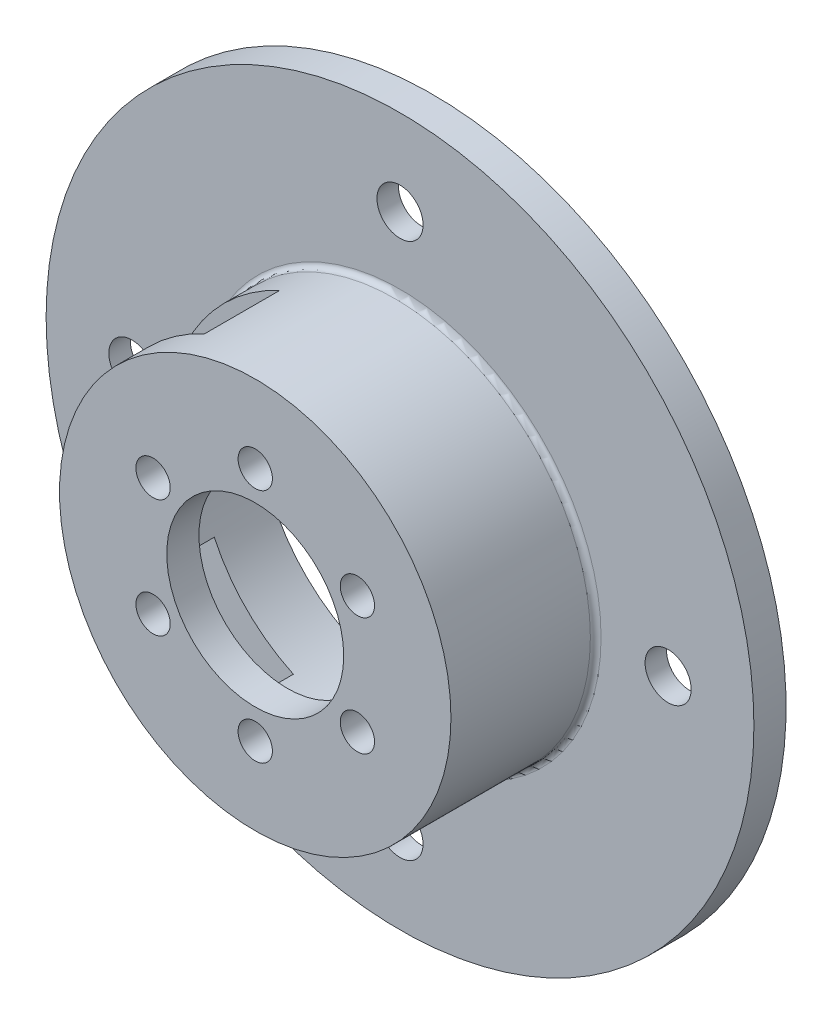
ISO-10303-21;
HEADER;
FILE_DESCRIPTION(('STEP AP214'),'2;1');
FILE_NAME('part.step','',(''),(''),'','','');
FILE_SCHEMA(('AUTOMOTIVE_DESIGN { 1 0 10303 214 1 1 1 1 }'));
ENDSEC;
DATA;
#1=APPLICATION_CONTEXT('core data for automotive mechanical design processes');
#2=APPLICATION_PROTOCOL_DEFINITION('international standard','automotive_design',2000,#1);
#3=PRODUCT_CONTEXT('',#1,'mechanical');
#4=PRODUCT('Part','Part','',(#3));
#5=PRODUCT_RELATED_PRODUCT_CATEGORY('part','',(#4));
#6=PRODUCT_DEFINITION_FORMATION('','',#4);
#7=PRODUCT_DEFINITION_CONTEXT('part definition',#1,'design');
#8=PRODUCT_DEFINITION('design','',#6,#7);
#9=PRODUCT_DEFINITION_SHAPE('','',#8);
#10=(LENGTH_UNIT() NAMED_UNIT(*) SI_UNIT(.MILLI.,.METRE.));
#11=(NAMED_UNIT(*) PLANE_ANGLE_UNIT() SI_UNIT($,.RADIAN.));
#12=(NAMED_UNIT(*) SI_UNIT($,.STERADIAN.) SOLID_ANGLE_UNIT());
#13=UNCERTAINTY_MEASURE_WITH_UNIT(LENGTH_MEASURE(1.E-05),#10,'distance_accuracy_value','');
#14=(GEOMETRIC_REPRESENTATION_CONTEXT(3) GLOBAL_UNCERTAINTY_ASSIGNED_CONTEXT((#13)) GLOBAL_UNIT_ASSIGNED_CONTEXT((#10,
#11,#12)) REPRESENTATION_CONTEXT('',''));
#15=CARTESIAN_POINT('',(0.,0.,0.));
#16=DIRECTION('',(0.,0.,1.));
#17=DIRECTION('',(1.,0.,0.));
#18=AXIS2_PLACEMENT_3D('',#15,#16,#17);
#19=CARTESIAN_POINT('',(0.,0.,4.));
#20=DIRECTION('',(0.,0.,-1.));
#21=DIRECTION('',(-1.,0.,0.));
#22=AXIS2_PLACEMENT_3D('',#19,#20,#21);
#23=CYLINDRICAL_SURFACE('',#22,15.25);
#24=DIRECTION('',(0.,0.,-1.));
#25=VECTOR('',#24,1.);
#26=CARTESIAN_POINT('',(-13.821193752309,6.44492849154558,4.));
#27=LINE('',#26,#25);
#28=CARTESIAN_POINT('',(-13.821193752309,6.44492849154558,7.5));
#29=VERTEX_POINT('',#28);
#30=CARTESIAN_POINT('',(-13.821193752309,6.44492849154558,14.));
#31=VERTEX_POINT('',#30);
#32=EDGE_CURVE('E168',#29,#31,#27,.F.);
#33=ORIENTED_EDGE('',*,*,#32,.T.);
#34=CARTESIAN_POINT('',(0.,0.,14.));
#35=DIRECTION('',(0.,0.,1.));
#36=DIRECTION('',(1.,0.,0.));
#37=AXIS2_PLACEMENT_3D('',#34,#35,#36);
#38=CIRCLE('',#37,15.25);
#39=CARTESIAN_POINT('',(-13.8211937523088,-6.44492849154597,14.));
#40=VERTEX_POINT('',#39);
#41=EDGE_CURVE('E224',#31,#40,#38,.T.);
#42=ORIENTED_EDGE('',*,*,#41,.T.);
#43=DIRECTION('',(0.,0.,-1.));
#44=VECTOR('',#43,1.);
#45=CARTESIAN_POINT('',(-13.8211937523088,-6.44492849154597,4.));
#46=LINE('',#45,#44);
#47=CARTESIAN_POINT('',(-13.8211937523088,-6.44492849154597,7.5));
#48=VERTEX_POINT('',#47);
#49=EDGE_CURVE('E140',#48,#40,#46,.F.);
#50=ORIENTED_EDGE('',*,*,#49,.F.);
#51=CARTESIAN_POINT('',(0.,0.,7.5));
#52=DIRECTION('',(0.,0.,1.));
#53=DIRECTION('',(1.,0.,0.));
#54=AXIS2_PLACEMENT_3D('',#51,#52,#53);
#55=CIRCLE('',#54,15.25);
#56=CARTESIAN_POINT('',(-6.44492849154553,-13.821193752309,7.5));
#57=VERTEX_POINT('',#56);
#58=EDGE_CURVE('E115',#48,#57,#55,.T.);
#59=ORIENTED_EDGE('',*,*,#58,.T.);
#60=DIRECTION('',(0.,0.,-1.));
#61=VECTOR('',#60,1.);
#62=CARTESIAN_POINT('',(-6.44492849154553,-13.821193752309,4.));
#63=LINE('',#62,#61);
#64=CARTESIAN_POINT('',(-6.44492849154553,-13.821193752309,14.5));
#65=VERTEX_POINT('',#64);
#66=EDGE_CURVE('E143',#57,#65,#63,.F.);
#67=ORIENTED_EDGE('',*,*,#66,.T.);
#68=CARTESIAN_POINT('',(0.,0.,14.5));
#69=DIRECTION('',(0.,0.,1.));
#70=DIRECTION('',(1.,0.,0.));
#71=AXIS2_PLACEMENT_3D('',#68,#69,#70);
#72=CIRCLE('',#71,15.25);
#73=CARTESIAN_POINT('',(-6.44492849154592,13.8211937523088,14.5));
#74=VERTEX_POINT('',#73);
#75=EDGE_CURVE('E214',#65,#74,#72,.T.);
#76=ORIENTED_EDGE('',*,*,#75,.T.);
#77=DIRECTION('',(0.,0.,-1.));
#78=VECTOR('',#77,1.);
#79=CARTESIAN_POINT('',(-6.44492849154592,13.8211937523088,4.));
#80=LINE('',#79,#78);
#81=CARTESIAN_POINT('',(-6.44492849154592,13.8211937523088,7.5));
#82=VERTEX_POINT('',#81);
#83=EDGE_CURVE('E163',#82,#74,#80,.F.);
#84=ORIENTED_EDGE('',*,*,#83,.F.);
#85=CARTESIAN_POINT('',(0.,0.,7.5));
#86=DIRECTION('',(0.,0.,1.));
#87=DIRECTION('',(1.,0.,0.));
#88=AXIS2_PLACEMENT_3D('',#85,#86,#87);
#89=CIRCLE('',#88,15.25);
#90=EDGE_CURVE('E171',#82,#29,#89,.T.);
#91=ORIENTED_EDGE('',*,*,#90,.T.);
#92=EDGE_LOOP('',(#33,#42,#50,#59,#67,#76,#84,#91));
#93=FACE_BOUND('',#92,.T.);
#94=CARTESIAN_POINT('',(0.,0.,2.));
#95=DIRECTION('',(0.,0.,-1.));
#96=DIRECTION('',(-1.,0.,0.));
#97=AXIS2_PLACEMENT_3D('',#94,#95,#96);
#98=CIRCLE('',#97,15.25);
#99=CARTESIAN_POINT('',(-15.25,0.,2.));
#100=VERTEX_POINT('',#99);
#101=EDGE_CURVE('E398',#100,#100,#98,.T.);
#102=ORIENTED_EDGE('',*,*,#101,.T.);
#103=EDGE_LOOP('',(#102));
#104=FACE_BOUND('',#103,.T.);
#105=ADVANCED_FACE('F36',(#93,#104),#23,.F.);
#106=CARTESIAN_POINT('',(-24.9999999999993,-7.04419501764363E-13,4.));
#107=DIRECTION('',(0.,0.,1.));
#108=DIRECTION('',(1.,0.,0.));
#109=AXIS2_PLACEMENT_3D('',#106,#107,#108);
#110=CYLINDRICAL_SURFACE('',#109,2.15);
#111=CARTESIAN_POINT('',(-24.9999999999993,-7.04419501764363E-13,4.));
#112=DIRECTION('',(0.,0.,1.));
#113=DIRECTION('',(1.,0.,0.));
#114=AXIS2_PLACEMENT_3D('',#111,#112,#113);
#115=CIRCLE('',#114,2.15);
#116=CARTESIAN_POINT('',(-22.8499999999993,-7.04419501764363E-13,4.));
#117=VERTEX_POINT('',#116);
#118=EDGE_CURVE('E227',#117,#117,#115,.T.);
#119=ORIENTED_EDGE('',*,*,#118,.T.);
#120=EDGE_LOOP('',(#119));
#121=FACE_BOUND('',#120,.T.);
#122=CARTESIAN_POINT('',(-24.9999999999993,-7.04419501764363E-13,2.));
#123=DIRECTION('',(0.,0.,-1.));
#124=DIRECTION('',(-1.,0.,0.));
#125=AXIS2_PLACEMENT_3D('',#122,#123,#124);
#126=CIRCLE('',#125,2.15);
#127=CARTESIAN_POINT('',(-27.1499999999993,-7.04419501764363E-13,2.));
#128=VERTEX_POINT('',#127);
#129=EDGE_CURVE('E396',#128,#128,#126,.F.);
#130=ORIENTED_EDGE('',*,*,#129,.F.);
#131=EDGE_LOOP('',(#130));
#132=FACE_BOUND('',#131,.T.);
#133=ADVANCED_FACE('F262',(#121,#132),#110,.F.);
#134=CARTESIAN_POINT('',(1.41496223752446E-12,-25.,4.));
#135=DIRECTION('',(0.,0.,1.));
#136=DIRECTION('',(1.,0.,0.));
#137=AXIS2_PLACEMENT_3D('',#134,#135,#136);
#138=CYLINDRICAL_SURFACE('',#137,2.15);
#139=CARTESIAN_POINT('',(1.41496223752446E-12,-25.,4.));
#140=DIRECTION('',(0.,0.,1.));
#141=DIRECTION('',(1.,0.,0.));
#142=AXIS2_PLACEMENT_3D('',#139,#140,#141);
#143=CIRCLE('',#142,2.15);
#144=CARTESIAN_POINT('',(2.15000000000141,-25.,4.));
#145=VERTEX_POINT('',#144);
#146=EDGE_CURVE('E409',#145,#145,#143,.T.);
#147=ORIENTED_EDGE('',*,*,#146,.T.);
#148=EDGE_LOOP('',(#147));
#149=FACE_BOUND('',#148,.T.);
#150=CARTESIAN_POINT('',(1.41496223752446E-12,-25.,2.));
#151=DIRECTION('',(0.,0.,-1.));
#152=DIRECTION('',(-1.,0.,0.));
#153=AXIS2_PLACEMENT_3D('',#150,#151,#152);
#154=CIRCLE('',#153,2.15);
#155=CARTESIAN_POINT('',(-2.14999999999858,-25.,2.));
#156=VERTEX_POINT('',#155);
#157=EDGE_CURVE('E393',#156,#156,#154,.F.);
#158=ORIENTED_EDGE('',*,*,#157,.F.);
#159=EDGE_LOOP('',(#158));
#160=FACE_BOUND('',#159,.T.);
#161=ADVANCED_FACE('F268',(#149,#160),#138,.F.);
#162=CARTESIAN_POINT('',(25.0000000000007,7.07481118762232E-13,4.));
#163=DIRECTION('',(0.,0.,1.));
#164=DIRECTION('',(1.,0.,0.));
#165=AXIS2_PLACEMENT_3D('',#162,#163,#164);
#166=CYLINDRICAL_SURFACE('',#165,2.15);
#167=CARTESIAN_POINT('',(25.0000000000007,7.07481118762232E-13,4.));
#168=DIRECTION('',(0.,0.,1.));
#169=DIRECTION('',(1.,0.,0.));
#170=AXIS2_PLACEMENT_3D('',#167,#168,#169);
#171=CIRCLE('',#170,2.15);
#172=CARTESIAN_POINT('',(27.1500000000007,7.07481118762232E-13,4.));
#173=VERTEX_POINT('',#172);
#174=EDGE_CURVE('E406',#173,#173,#171,.T.);
#175=ORIENTED_EDGE('',*,*,#174,.T.);
#176=EDGE_LOOP('',(#175));
#177=FACE_BOUND('',#176,.T.);
#178=CARTESIAN_POINT('',(25.0000000000007,7.07481118762232E-13,2.));
#179=DIRECTION('',(0.,0.,-1.));
#180=DIRECTION('',(-1.,0.,0.));
#181=AXIS2_PLACEMENT_3D('',#178,#179,#180);
#182=CIRCLE('',#181,2.15);
#183=CARTESIAN_POINT('',(22.8500000000007,7.07481118762232E-13,2.));
#184=VERTEX_POINT('',#183);
#185=EDGE_CURVE('E244',#184,#184,#182,.F.);
#186=ORIENTED_EDGE('',*,*,#185,.F.);
#187=EDGE_LOOP('',(#186));
#188=FACE_BOUND('',#187,.T.);
#189=ADVANCED_FACE('F371',(#177,#188),#166,.F.);
#190=CARTESIAN_POINT('',(0.,25.,4.));
#191=DIRECTION('',(0.,0.,1.));
#192=DIRECTION('',(1.,0.,0.));
#193=AXIS2_PLACEMENT_3D('',#190,#191,#192);
#194=CYLINDRICAL_SURFACE('',#193,2.15);
#195=CARTESIAN_POINT('',(0.,25.,4.));
#196=DIRECTION('',(0.,0.,1.));
#197=DIRECTION('',(1.,0.,0.));
#198=AXIS2_PLACEMENT_3D('',#195,#196,#197);
#199=CIRCLE('',#198,2.15);
#200=CARTESIAN_POINT('',(2.15,25.,4.));
#201=VERTEX_POINT('',#200);
#202=EDGE_CURVE('E383',#201,#201,#199,.T.);
#203=ORIENTED_EDGE('',*,*,#202,.T.);
#204=EDGE_LOOP('',(#203));
#205=FACE_BOUND('',#204,.T.);
#206=CARTESIAN_POINT('',(0.,25.,2.));
#207=DIRECTION('',(0.,0.,-1.));
#208=DIRECTION('',(-1.,0.,0.));
#209=AXIS2_PLACEMENT_3D('',#206,#207,#208);
#210=CIRCLE('',#209,2.15);
#211=CARTESIAN_POINT('',(-2.15,25.,2.));
#212=VERTEX_POINT('',#211);
#213=EDGE_CURVE('E242',#212,#212,#210,.F.);
#214=ORIENTED_EDGE('',*,*,#213,.F.);
#215=EDGE_LOOP('',(#214));
#216=FACE_BOUND('',#215,.T.);
#217=ADVANCED_FACE('F283',(#205,#216),#194,.F.);
#218=CARTESIAN_POINT('',(0.,0.,4.));
#219=DIRECTION('',(0.,0.,-1.));
#220=DIRECTION('',(-1.,0.,0.));
#221=AXIS2_PLACEMENT_3D('',#218,#219,#220);
#222=CYLINDRICAL_SURFACE('',#221,33.);
#223=CARTESIAN_POINT('',(0.,0.,4.));
#224=DIRECTION('',(0.,0.,1.));
#225=DIRECTION('',(1.,0.,0.));
#226=AXIS2_PLACEMENT_3D('',#223,#224,#225);
#227=CIRCLE('',#226,33.);
#228=CARTESIAN_POINT('',(33.,0.,4.));
#229=VERTEX_POINT('',#228);
#230=EDGE_CURVE('E221',#229,#229,#227,.T.);
#231=ORIENTED_EDGE('',*,*,#230,.F.);
#232=EDGE_LOOP('',(#231));
#233=FACE_BOUND('',#232,.T.);
#234=CARTESIAN_POINT('',(0.,0.,1.));
#235=DIRECTION('',(0.,0.,-1.));
#236=DIRECTION('',(-1.,0.,0.));
#237=AXIS2_PLACEMENT_3D('',#234,#235,#236);
#238=CIRCLE('',#237,33.);
#239=CARTESIAN_POINT('',(-33.,0.,1.));
#240=VERTEX_POINT('',#239);
#241=EDGE_CURVE('E136',#240,#240,#238,.T.);
#242=ORIENTED_EDGE('',*,*,#241,.F.);
#243=EDGE_LOOP('',(#242));
#244=FACE_BOUND('',#243,.T.);
#245=ADVANCED_FACE('F280',(#233,#244),#222,.T.);
#246=CARTESIAN_POINT('',(0.,0.,17.5));
#247=DIRECTION('',(0.,0.,-1.));
#248=DIRECTION('',(-1.,0.,0.));
#249=AXIS2_PLACEMENT_3D('',#246,#247,#248);
#250=CYLINDRICAL_SURFACE('',#249,18.25);
#251=CARTESIAN_POINT('',(0.,0.,4.5));
#252=DIRECTION('',(0.,0.,1.));
#253=DIRECTION('',(1.,0.,0.));
#254=AXIS2_PLACEMENT_3D('',#251,#252,#253);
#255=CIRCLE('',#254,18.25);
#256=CARTESIAN_POINT('',(18.25,0.,4.5));
#257=VERTEX_POINT('',#256);
#258=EDGE_CURVE('E232',#257,#257,#255,.T.);
#259=ORIENTED_EDGE('',*,*,#258,.T.);
#260=EDGE_LOOP('',(#259));
#261=FACE_BOUND('',#260,.T.);
#262=CARTESIAN_POINT('',(0.,0.,7.5));
#263=DIRECTION('',(0.,0.,1.));
#264=DIRECTION('',(1.,0.,0.));
#265=AXIS2_PLACEMENT_3D('',#262,#263,#264);
#266=CIRCLE('',#265,18.25);
#267=CARTESIAN_POINT('',(-7.71278327676807,16.5401171134187,7.5));
#268=VERTEX_POINT('',#267);
#269=CARTESIAN_POINT('',(-16.5401171134189,7.71278327676766,7.5));
#270=VERTEX_POINT('',#269);
#271=EDGE_CURVE('E150',#268,#270,#266,.T.);
#272=ORIENTED_EDGE('',*,*,#271,.F.);
#273=DIRECTION('',(0.,0.,1.));
#274=VECTOR('',#273,1.);
#275=CARTESIAN_POINT('',(-7.71278327676807,16.5401171134187,7.5));
#276=LINE('',#275,#274);
#277=CARTESIAN_POINT('',(-7.71278327676807,16.5401171134187,14.5));
#278=VERTEX_POINT('',#277);
#279=EDGE_CURVE('E155',#268,#278,#276,.T.);
#280=ORIENTED_EDGE('',*,*,#279,.T.);
#281=CARTESIAN_POINT('',(0.,0.,14.5));
#282=DIRECTION('',(0.,0.,1.));
#283=DIRECTION('',(1.,0.,0.));
#284=AXIS2_PLACEMENT_3D('',#281,#282,#283);
#285=CIRCLE('',#284,18.25);
#286=CARTESIAN_POINT('',(-16.5401171134189,7.71278327676766,14.5));
#287=VERTEX_POINT('',#286);
#288=EDGE_CURVE('E157',#278,#287,#285,.T.);
#289=ORIENTED_EDGE('',*,*,#288,.T.);
#290=DIRECTION('',(0.,0.,1.));
#291=VECTOR('',#290,1.);
#292=CARTESIAN_POINT('',(-16.5401171134189,7.71278327676766,7.5));
#293=LINE('',#292,#291);
#294=EDGE_CURVE('E161',#270,#287,#293,.T.);
#295=ORIENTED_EDGE('',*,*,#294,.F.);
#296=EDGE_LOOP('',(#272,#280,#289,#295));
#297=FACE_BOUND('',#296,.T.);
#298=CARTESIAN_POINT('',(0.,0.,17.5));
#299=DIRECTION('',(0.,0.,1.));
#300=DIRECTION('',(1.,0.,0.));
#301=AXIS2_PLACEMENT_3D('',#298,#299,#300);
#302=CIRCLE('',#301,18.25);
#303=CARTESIAN_POINT('',(18.25,0.,17.5));
#304=VERTEX_POINT('',#303);
#305=EDGE_CURVE('E218',#304,#304,#302,.T.);
#306=ORIENTED_EDGE('',*,*,#305,.F.);
#307=EDGE_LOOP('',(#306));
#308=FACE_BOUND('',#307,.T.);
#309=CARTESIAN_POINT('',(0.,0.,7.5));
#310=DIRECTION('',(0.,0.,1.));
#311=DIRECTION('',(1.,0.,0.));
#312=AXIS2_PLACEMENT_3D('',#309,#310,#311);
#313=CIRCLE('',#312,18.25);
#314=CARTESIAN_POINT('',(-16.5401171134187,-7.71278327676813,7.5));
#315=VERTEX_POINT('',#314);
#316=CARTESIAN_POINT('',(-7.7127832767676,-16.5401171134189,7.5));
#317=VERTEX_POINT('',#316);
#318=EDGE_CURVE('E112',#315,#317,#313,.T.);
#319=ORIENTED_EDGE('',*,*,#318,.F.);
#320=DIRECTION('',(0.,0.,1.));
#321=VECTOR('',#320,1.);
#322=CARTESIAN_POINT('',(-16.5401171134187,-7.71278327676813,7.5));
#323=LINE('',#322,#321);
#324=CARTESIAN_POINT('',(-16.5401171134187,-7.71278327676813,14.5));
#325=VERTEX_POINT('',#324);
#326=EDGE_CURVE('E122',#315,#325,#323,.T.);
#327=ORIENTED_EDGE('',*,*,#326,.T.);
#328=CARTESIAN_POINT('',(0.,0.,14.5));
#329=DIRECTION('',(0.,0.,1.));
#330=DIRECTION('',(1.,0.,0.));
#331=AXIS2_PLACEMENT_3D('',#328,#329,#330);
#332=CIRCLE('',#331,18.25);
#333=CARTESIAN_POINT('',(-7.7127832767676,-16.5401171134189,14.5));
#334=VERTEX_POINT('',#333);
#335=EDGE_CURVE('E135',#325,#334,#332,.T.);
#336=ORIENTED_EDGE('',*,*,#335,.T.);
#337=DIRECTION('',(0.,0.,1.));
#338=VECTOR('',#337,1.);
#339=CARTESIAN_POINT('',(-7.7127832767676,-16.5401171134189,7.5));
#340=LINE('',#339,#338);
#341=EDGE_CURVE('E126',#317,#334,#340,.T.);
#342=ORIENTED_EDGE('',*,*,#341,.F.);
#343=EDGE_LOOP('',(#319,#327,#336,#342));
#344=FACE_BOUND('',#343,.T.);
#345=ADVANCED_FACE('F129',(#261,#297,#308,#344),#250,.T.);
#346=CARTESIAN_POINT('',(0.,0.,4.));
#347=DIRECTION('',(0.,0.,1.));
#348=DIRECTION('',(1.,0.,0.));
#349=AXIS2_PLACEMENT_3D('',#346,#347,#348);
#350=PLANE('',#349);
#351=CARTESIAN_POINT('',(0.,0.,4.));
#352=DIRECTION('',(0.,0.,1.));
#353=DIRECTION('',(1.,0.,0.));
#354=AXIS2_PLACEMENT_3D('',#351,#352,#353);
#355=CIRCLE('',#354,18.75);
#356=CARTESIAN_POINT('',(18.75,0.,4.));
#357=VERTEX_POINT('',#356);
#358=EDGE_CURVE('E235',#357,#357,#355,.F.);
#359=ORIENTED_EDGE('',*,*,#358,.T.);
#360=EDGE_LOOP('',(#359));
#361=FACE_BOUND('',#360,.T.);
#362=ORIENTED_EDGE('',*,*,#202,.F.);
#363=EDGE_LOOP('',(#362));
#364=FACE_BOUND('',#363,.T.);
#365=ORIENTED_EDGE('',*,*,#174,.F.);
#366=EDGE_LOOP('',(#365));
#367=FACE_BOUND('',#366,.T.);
#368=ORIENTED_EDGE('',*,*,#146,.F.);
#369=EDGE_LOOP('',(#368));
#370=FACE_BOUND('',#369,.T.);
#371=ORIENTED_EDGE('',*,*,#118,.F.);
#372=EDGE_LOOP('',(#371));
#373=FACE_BOUND('',#372,.T.);
#374=ORIENTED_EDGE('',*,*,#230,.T.);
#375=EDGE_LOOP('',(#374));
#376=FACE_BOUND('',#375,.T.);
#377=ADVANCED_FACE('F275',(#361,#364,#367,#370,#373,#376),#350,.T.);
#378=CARTESIAN_POINT('',(0.,0.,17.5));
#379=DIRECTION('',(0.,0.,1.));
#380=DIRECTION('',(1.,0.,0.));
#381=AXIS2_PLACEMENT_3D('',#378,#379,#380);
#382=PLANE('',#381);
#383=CARTESIAN_POINT('',(0.,11.,17.5));
#384=DIRECTION('',(0.,0.,1.));
#385=DIRECTION('',(1.,0.,0.));
#386=AXIS2_PLACEMENT_3D('',#383,#384,#385);
#387=CIRCLE('',#386,1.59999999999999);
#388=CARTESIAN_POINT('',(1.59999999999999,11.,17.5));
#389=VERTEX_POINT('',#388);
#390=EDGE_CURVE('E174',#389,#389,#387,.T.);
#391=ORIENTED_EDGE('',*,*,#390,.F.);
#392=EDGE_LOOP('',(#391));
#393=FACE_BOUND('',#392,.T.);
#394=CARTESIAN_POINT('',(9.52627944162898,5.50000000000027,17.5));
#395=DIRECTION('',(0.,0.,1.));
#396=DIRECTION('',(1.,0.,0.));
#397=AXIS2_PLACEMENT_3D('',#394,#395,#396);
#398=CIRCLE('',#397,1.59999999999999);
#399=CARTESIAN_POINT('',(11.126279441629,5.50000000000027,17.5));
#400=VERTEX_POINT('',#399);
#401=EDGE_CURVE('E180',#400,#400,#398,.T.);
#402=ORIENTED_EDGE('',*,*,#401,.F.);
#403=EDGE_LOOP('',(#402));
#404=FACE_BOUND('',#403,.T.);
#405=CARTESIAN_POINT('',(9.52627944162929,-5.49999999999973,17.5));
#406=DIRECTION('',(0.,0.,1.));
#407=DIRECTION('',(1.,0.,0.));
#408=AXIS2_PLACEMENT_3D('',#405,#406,#407);
#409=CIRCLE('',#408,1.59999999999999);
#410=CARTESIAN_POINT('',(11.1262794416293,-5.49999999999973,17.5));
#411=VERTEX_POINT('',#410);
#412=EDGE_CURVE('E186',#411,#411,#409,.T.);
#413=ORIENTED_EDGE('',*,*,#412,.F.);
#414=EDGE_LOOP('',(#413));
#415=FACE_BOUND('',#414,.T.);
#416=CARTESIAN_POINT('',(6.22583384510764E-13,-11.,17.5));
#417=DIRECTION('',(0.,0.,1.));
#418=DIRECTION('',(1.,0.,0.));
#419=AXIS2_PLACEMENT_3D('',#416,#417,#418);
#420=CIRCLE('',#419,1.59999999999999);
#421=CARTESIAN_POINT('',(1.60000000000061,-11.,17.5));
#422=VERTEX_POINT('',#421);
#423=EDGE_CURVE('E192',#422,#422,#420,.T.);
#424=ORIENTED_EDGE('',*,*,#423,.F.);
#425=EDGE_LOOP('',(#424));
#426=FACE_BOUND('',#425,.T.);
#427=CARTESIAN_POINT('',(-9.52627944162836,-5.50000000000027,17.5));
#428=DIRECTION('',(0.,0.,1.));
#429=DIRECTION('',(1.,0.,0.));
#430=AXIS2_PLACEMENT_3D('',#427,#428,#429);
#431=CIRCLE('',#430,1.59999999999999);
#432=CARTESIAN_POINT('',(-7.92627944162837,-5.50000000000027,17.5));
#433=VERTEX_POINT('',#432);
#434=EDGE_CURVE('E198',#433,#433,#431,.T.);
#435=ORIENTED_EDGE('',*,*,#434,.F.);
#436=EDGE_LOOP('',(#435));
#437=FACE_BOUND('',#436,.T.);
#438=CARTESIAN_POINT('',(-9.52627944162867,5.49999999999973,17.5));
#439=DIRECTION('',(0.,0.,1.));
#440=DIRECTION('',(1.,0.,0.));
#441=AXIS2_PLACEMENT_3D('',#438,#439,#440);
#442=CIRCLE('',#441,1.59999999999999);
#443=CARTESIAN_POINT('',(-7.92627944162868,5.49999999999973,17.5));
#444=VERTEX_POINT('',#443);
#445=EDGE_CURVE('E204',#444,#444,#442,.T.);
#446=ORIENTED_EDGE('',*,*,#445,.F.);
#447=EDGE_LOOP('',(#446));
#448=FACE_BOUND('',#447,.T.);
#449=ORIENTED_EDGE('',*,*,#305,.T.);
#450=EDGE_LOOP('',(#449));
#451=FACE_BOUND('',#450,.T.);
#452=CARTESIAN_POINT('',(0.,0.,17.5));
#453=DIRECTION('',(0.,0.,1.));
#454=DIRECTION('',(1.,0.,0.));
#455=AXIS2_PLACEMENT_3D('',#452,#453,#454);
#456=CIRCLE('',#455,8.25);
#457=CARTESIAN_POINT('',(8.25,0.,17.5));
#458=VERTEX_POINT('',#457);
#459=EDGE_CURVE('E210',#458,#458,#456,.T.);
#460=ORIENTED_EDGE('',*,*,#459,.F.);
#461=EDGE_LOOP('',(#460));
#462=FACE_BOUND('',#461,.T.);
#463=ADVANCED_FACE('F278',(#393,#404,#415,#426,#437,#448,#451,#462),#382,.T.);
#464=CARTESIAN_POINT('',(0.,0.,14.5));
#465=DIRECTION('',(0.,0.,1.));
#466=DIRECTION('',(1.,0.,0.));
#467=AXIS2_PLACEMENT_3D('',#464,#465,#466);
#468=PLANE('',#467);
#469=DIRECTION('',(-0.906307787036641,-0.422618261740719,0.));
#470=VECTOR('',#469,1.);
#471=CARTESIAN_POINT('',(0.,0.,14.5));
#472=LINE('',#471,#470);
#473=CARTESIAN_POINT('',(-13.3680398587904,-6.23361936067561,14.5));
#474=VERTEX_POINT('',#473);
#475=EDGE_CURVE('E51',#474,#325,#472,.T.);
#476=ORIENTED_EDGE('',*,*,#475,.F.);
#477=CARTESIAN_POINT('',(0.,0.,14.5));
#478=DIRECTION('',(0.,0.,1.));
#479=DIRECTION('',(1.,0.,0.));
#480=AXIS2_PLACEMENT_3D('',#477,#478,#479);
#481=CIRCLE('',#480,14.75);
#482=CARTESIAN_POINT('',(-13.3680398587906,6.23361936067523,14.5));
#483=VERTEX_POINT('',#482);
#484=EDGE_CURVE('E230',#474,#483,#481,.F.);
#485=ORIENTED_EDGE('',*,*,#484,.T.);
#486=DIRECTION('',(-0.906307787036653,0.422618261740694,0.));
#487=VECTOR('',#486,1.);
#488=CARTESIAN_POINT('',(0.,0.,14.5));
#489=LINE('',#488,#487);
#490=EDGE_CURVE('E59',#483,#287,#489,.T.);
#491=ORIENTED_EDGE('',*,*,#490,.T.);
#492=ORIENTED_EDGE('',*,*,#288,.F.);
#493=DIRECTION('',(-0.422618261740716,0.906307787036642,0.));
#494=VECTOR('',#493,1.);
#495=CARTESIAN_POINT('',(0.,0.,14.5));
#496=LINE('',#495,#494);
#497=EDGE_CURVE('E147',#74,#278,#496,.T.);
#498=ORIENTED_EDGE('',*,*,#497,.F.);
#499=ORIENTED_EDGE('',*,*,#75,.F.);
#500=DIRECTION('',(-0.422618261740691,-0.906307787036654,0.));
#501=VECTOR('',#500,1.);
#502=CARTESIAN_POINT('',(0.,0.,14.5));
#503=LINE('',#502,#501);
#504=EDGE_CURVE('E119',#65,#334,#503,.T.);
#505=ORIENTED_EDGE('',*,*,#504,.T.);
#506=ORIENTED_EDGE('',*,*,#335,.F.);
#507=EDGE_LOOP('',(#476,#485,#491,#492,#498,#499,#505,#506));
#508=FACE_BOUND('',#507,.T.);
#509=CARTESIAN_POINT('',(0.,11.,14.5));
#510=DIRECTION('',(0.,0.,1.));
#511=DIRECTION('',(1.,0.,0.));
#512=AXIS2_PLACEMENT_3D('',#509,#510,#511);
#513=CIRCLE('',#512,1.59999999999999);
#514=CARTESIAN_POINT('',(1.59999999999999,11.,14.5));
#515=VERTEX_POINT('',#514);
#516=EDGE_CURVE('E177',#515,#515,#513,.T.);
#517=ORIENTED_EDGE('',*,*,#516,.T.);
#518=EDGE_LOOP('',(#517));
#519=FACE_BOUND('',#518,.T.);
#520=CARTESIAN_POINT('',(9.52627944162898,5.50000000000027,14.5));
#521=DIRECTION('',(0.,0.,1.));
#522=DIRECTION('',(1.,0.,0.));
#523=AXIS2_PLACEMENT_3D('',#520,#521,#522);
#524=CIRCLE('',#523,1.59999999999999);
#525=CARTESIAN_POINT('',(11.126279441629,5.50000000000027,14.5));
#526=VERTEX_POINT('',#525);
#527=EDGE_CURVE('E183',#526,#526,#524,.T.);
#528=ORIENTED_EDGE('',*,*,#527,.T.);
#529=EDGE_LOOP('',(#528));
#530=FACE_BOUND('',#529,.T.);
#531=CARTESIAN_POINT('',(9.52627944162929,-5.49999999999973,14.5));
#532=DIRECTION('',(0.,0.,1.));
#533=DIRECTION('',(1.,0.,0.));
#534=AXIS2_PLACEMENT_3D('',#531,#532,#533);
#535=CIRCLE('',#534,1.59999999999999);
#536=CARTESIAN_POINT('',(11.1262794416293,-5.49999999999973,14.5));
#537=VERTEX_POINT('',#536);
#538=EDGE_CURVE('E189',#537,#537,#535,.T.);
#539=ORIENTED_EDGE('',*,*,#538,.T.);
#540=EDGE_LOOP('',(#539));
#541=FACE_BOUND('',#540,.T.);
#542=CARTESIAN_POINT('',(6.22583384510764E-13,-11.,14.5));
#543=DIRECTION('',(0.,0.,1.));
#544=DIRECTION('',(1.,0.,0.));
#545=AXIS2_PLACEMENT_3D('',#542,#543,#544);
#546=CIRCLE('',#545,1.59999999999999);
#547=CARTESIAN_POINT('',(1.60000000000061,-11.,14.5));
#548=VERTEX_POINT('',#547);
#549=EDGE_CURVE('E195',#548,#548,#546,.T.);
#550=ORIENTED_EDGE('',*,*,#549,.T.);
#551=EDGE_LOOP('',(#550));
#552=FACE_BOUND('',#551,.T.);
#553=CARTESIAN_POINT('',(-9.52627944162836,-5.50000000000027,14.5));
#554=DIRECTION('',(0.,0.,1.));
#555=DIRECTION('',(1.,0.,0.));
#556=AXIS2_PLACEMENT_3D('',#553,#554,#555);
#557=CIRCLE('',#556,1.59999999999999);
#558=CARTESIAN_POINT('',(-7.92627944162836,-5.50000000000027,14.5));
#559=VERTEX_POINT('',#558);
#560=EDGE_CURVE('E201',#559,#559,#557,.T.);
#561=ORIENTED_EDGE('',*,*,#560,.T.);
#562=EDGE_LOOP('',(#561));
#563=FACE_BOUND('',#562,.T.);
#564=CARTESIAN_POINT('',(-9.52627944162867,5.49999999999973,14.5));
#565=DIRECTION('',(0.,0.,1.));
#566=DIRECTION('',(1.,0.,0.));
#567=AXIS2_PLACEMENT_3D('',#564,#565,#566);
#568=CIRCLE('',#567,1.59999999999999);
#569=CARTESIAN_POINT('',(-7.92627944162868,5.49999999999973,14.5));
#570=VERTEX_POINT('',#569);
#571=EDGE_CURVE('E207',#570,#570,#568,.T.);
#572=ORIENTED_EDGE('',*,*,#571,.T.);
#573=EDGE_LOOP('',(#572));
#574=FACE_BOUND('',#573,.T.);
#575=CARTESIAN_POINT('',(0.,0.,14.5));
#576=DIRECTION('',(0.,0.,1.));
#577=DIRECTION('',(1.,0.,0.));
#578=AXIS2_PLACEMENT_3D('',#575,#576,#577);
#579=CIRCLE('',#578,8.25);
#580=CARTESIAN_POINT('',(8.25,0.,14.5));
#581=VERTEX_POINT('',#580);
#582=EDGE_CURVE('E211',#581,#581,#579,.T.);
#583=ORIENTED_EDGE('',*,*,#582,.T.);
#584=EDGE_LOOP('',(#583));
#585=FACE_BOUND('',#584,.T.);
#586=ADVANCED_FACE('F309',(#508,#519,#530,#541,#552,#563,#574,#585),#468,.F.);
#587=CARTESIAN_POINT('',(0.,0.,14.5));
#588=DIRECTION('',(0.,0.,1.));
#589=DIRECTION('',(1.,0.,0.));
#590=AXIS2_PLACEMENT_3D('',#587,#588,#589);
#591=CYLINDRICAL_SURFACE('',#590,8.25);
#592=ORIENTED_EDGE('',*,*,#582,.F.);
#593=EDGE_LOOP('',(#592));
#594=FACE_BOUND('',#593,.T.);
#595=ORIENTED_EDGE('',*,*,#459,.T.);
#596=EDGE_LOOP('',(#595));
#597=FACE_BOUND('',#596,.T.);
#598=ADVANCED_FACE('F313',(#594,#597),#591,.F.);
#599=CARTESIAN_POINT('',(-9.52627944162867,5.49999999999973,17.5));
#600=DIRECTION('',(0.,0.,1.));
#601=DIRECTION('',(1.,0.,0.));
#602=AXIS2_PLACEMENT_3D('',#599,#600,#601);
#603=CYLINDRICAL_SURFACE('',#602,1.59999999999999);
#604=ORIENTED_EDGE('',*,*,#445,.T.);
#605=EDGE_LOOP('',(#604));
#606=FACE_BOUND('',#605,.T.);
#607=ORIENTED_EDGE('',*,*,#571,.F.);
#608=EDGE_LOOP('',(#607));
#609=FACE_BOUND('',#608,.T.);
#610=ADVANCED_FACE('F315',(#606,#609),#603,.F.);
#611=CARTESIAN_POINT('',(-9.52627944162836,-5.50000000000027,17.5));
#612=DIRECTION('',(0.,0.,1.));
#613=DIRECTION('',(1.,0.,0.));
#614=AXIS2_PLACEMENT_3D('',#611,#612,#613);
#615=CYLINDRICAL_SURFACE('',#614,1.59999999999999);
#616=ORIENTED_EDGE('',*,*,#434,.T.);
#617=EDGE_LOOP('',(#616));
#618=FACE_BOUND('',#617,.T.);
#619=ORIENTED_EDGE('',*,*,#560,.F.);
#620=EDGE_LOOP('',(#619));
#621=FACE_BOUND('',#620,.T.);
#622=ADVANCED_FACE('F322',(#618,#621),#615,.F.);
#623=CARTESIAN_POINT('',(6.22583384510764E-13,-11.,17.5));
#624=DIRECTION('',(0.,0.,1.));
#625=DIRECTION('',(1.,0.,0.));
#626=AXIS2_PLACEMENT_3D('',#623,#624,#625);
#627=CYLINDRICAL_SURFACE('',#626,1.59999999999999);
#628=ORIENTED_EDGE('',*,*,#423,.T.);
#629=EDGE_LOOP('',(#628));
#630=FACE_BOUND('',#629,.T.);
#631=ORIENTED_EDGE('',*,*,#549,.F.);
#632=EDGE_LOOP('',(#631));
#633=FACE_BOUND('',#632,.T.);
#634=ADVANCED_FACE('F330',(#630,#633),#627,.F.);
#635=CARTESIAN_POINT('',(9.52627944162929,-5.49999999999973,17.5));
#636=DIRECTION('',(0.,0.,1.));
#637=DIRECTION('',(1.,0.,0.));
#638=AXIS2_PLACEMENT_3D('',#635,#636,#637);
#639=CYLINDRICAL_SURFACE('',#638,1.59999999999999);
#640=ORIENTED_EDGE('',*,*,#412,.T.);
#641=EDGE_LOOP('',(#640));
#642=FACE_BOUND('',#641,.T.);
#643=ORIENTED_EDGE('',*,*,#538,.F.);
#644=EDGE_LOOP('',(#643));
#645=FACE_BOUND('',#644,.T.);
#646=ADVANCED_FACE('F334',(#642,#645),#639,.F.);
#647=CARTESIAN_POINT('',(9.52627944162898,5.50000000000027,17.5));
#648=DIRECTION('',(0.,0.,1.));
#649=DIRECTION('',(1.,0.,0.));
#650=AXIS2_PLACEMENT_3D('',#647,#648,#649);
#651=CYLINDRICAL_SURFACE('',#650,1.59999999999999);
#652=ORIENTED_EDGE('',*,*,#401,.T.);
#653=EDGE_LOOP('',(#652));
#654=FACE_BOUND('',#653,.T.);
#655=ORIENTED_EDGE('',*,*,#527,.F.);
#656=EDGE_LOOP('',(#655));
#657=FACE_BOUND('',#656,.T.);
#658=ADVANCED_FACE('F338',(#654,#657),#651,.F.);
#659=CARTESIAN_POINT('',(0.,11.,17.5));
#660=DIRECTION('',(0.,0.,1.));
#661=DIRECTION('',(1.,0.,0.));
#662=AXIS2_PLACEMENT_3D('',#659,#660,#661);
#663=CYLINDRICAL_SURFACE('',#662,1.59999999999999);
#664=ORIENTED_EDGE('',*,*,#390,.T.);
#665=EDGE_LOOP('',(#664));
#666=FACE_BOUND('',#665,.T.);
#667=ORIENTED_EDGE('',*,*,#516,.F.);
#668=EDGE_LOOP('',(#667));
#669=FACE_BOUND('',#668,.T.);
#670=ADVANCED_FACE('F342',(#666,#669),#663,.F.);
#671=CARTESIAN_POINT('',(0.,0.,7.5));
#672=DIRECTION('',(0.422618261740694,0.906307787036653,0.));
#673=DIRECTION('',(-0.906307787036653,0.422618261740694,0.));
#674=AXIS2_PLACEMENT_3D('',#671,#672,#673);
#675=PLANE('',#674);
#676=DIRECTION('',(-0.906307787036653,0.422618261740694,0.));
#677=VECTOR('',#676,1.);
#678=CARTESIAN_POINT('',(0.,0.,7.5));
#679=LINE('',#678,#677);
#680=EDGE_CURVE('E153',#29,#270,#679,.T.);
#681=ORIENTED_EDGE('',*,*,#680,.T.);
#682=ORIENTED_EDGE('',*,*,#294,.T.);
#683=ORIENTED_EDGE('',*,*,#490,.F.);
#684=CARTESIAN_POINT('',(-13.3680398587906,6.23361936067523,14.));
#685=DIRECTION('',(0.422618261740694,0.906307787036653,0.));
#686=DIRECTION('',(-0.906307787036653,0.422618261740694,0.));
#687=AXIS2_PLACEMENT_3D('',#684,#685,#686);
#688=CIRCLE('',#687,0.5);
#689=EDGE_CURVE('E240',#483,#31,#688,.F.);
#690=ORIENTED_EDGE('',*,*,#689,.T.);
#691=ORIENTED_EDGE('',*,*,#32,.F.);
#692=EDGE_LOOP('',(#681,#682,#683,#690,#691));
#693=FACE_BOUND('',#692,.T.);
#694=ADVANCED_FACE('F346',(#693),#675,.T.);
#695=CARTESIAN_POINT('',(0.,0.,7.5));
#696=DIRECTION('',(0.906307787036642,0.422618261740716,0.));
#697=DIRECTION('',(-0.422618261740716,0.906307787036642,0.));
#698=AXIS2_PLACEMENT_3D('',#695,#696,#697);
#699=PLANE('',#698);
#700=ORIENTED_EDGE('',*,*,#83,.T.);
#701=ORIENTED_EDGE('',*,*,#497,.T.);
#702=ORIENTED_EDGE('',*,*,#279,.F.);
#703=DIRECTION('',(-0.422618261740716,0.906307787036642,0.));
#704=VECTOR('',#703,1.);
#705=CARTESIAN_POINT('',(0.,0.,7.5));
#706=LINE('',#705,#704);
#707=EDGE_CURVE('E148',#82,#268,#706,.T.);
#708=ORIENTED_EDGE('',*,*,#707,.F.);
#709=EDGE_LOOP('',(#700,#701,#702,#708));
#710=FACE_BOUND('',#709,.T.);
#711=ADVANCED_FACE('F348',(#710),#699,.F.);
#712=CARTESIAN_POINT('',(0.,0.,7.5));
#713=DIRECTION('',(0.,0.,1.));
#714=DIRECTION('',(1.,0.,0.));
#715=AXIS2_PLACEMENT_3D('',#712,#713,#714);
#716=PLANE('',#715);
#717=ORIENTED_EDGE('',*,*,#707,.T.);
#718=ORIENTED_EDGE('',*,*,#271,.T.);
#719=ORIENTED_EDGE('',*,*,#680,.F.);
#720=ORIENTED_EDGE('',*,*,#90,.F.);
#721=EDGE_LOOP('',(#717,#718,#719,#720));
#722=FACE_BOUND('',#721,.T.);
#723=ADVANCED_FACE('F351',(#722),#716,.T.);
#724=CARTESIAN_POINT('',(0.,0.,7.5));
#725=DIRECTION('',(-0.906307787036654,0.422618261740691,0.));
#726=DIRECTION('',(-0.422618261740691,-0.906307787036654,0.));
#727=AXIS2_PLACEMENT_3D('',#724,#725,#726);
#728=PLANE('',#727);
#729=DIRECTION('',(-0.422618261740691,-0.906307787036654,0.));
#730=VECTOR('',#729,1.);
#731=CARTESIAN_POINT('',(0.,0.,7.5));
#732=LINE('',#731,#730);
#733=EDGE_CURVE('E127',#57,#317,#732,.T.);
#734=ORIENTED_EDGE('',*,*,#733,.T.);
#735=ORIENTED_EDGE('',*,*,#341,.T.);
#736=ORIENTED_EDGE('',*,*,#504,.F.);
#737=ORIENTED_EDGE('',*,*,#66,.F.);
#738=EDGE_LOOP('',(#734,#735,#736,#737));
#739=FACE_BOUND('',#738,.T.);
#740=ADVANCED_FACE('F357',(#739),#728,.T.);
#741=CARTESIAN_POINT('',(0.,0.,7.5));
#742=DIRECTION('',(-0.422618261740719,0.906307787036641,0.));
#743=DIRECTION('',(-0.906307787036641,-0.422618261740719,0.));
#744=AXIS2_PLACEMENT_3D('',#741,#742,#743);
#745=PLANE('',#744);
#746=ORIENTED_EDGE('',*,*,#49,.T.);
#747=CARTESIAN_POINT('',(-13.3680398587904,-6.23361936067561,14.));
#748=DIRECTION('',(-0.422618261740719,0.906307787036641,0.));
#749=DIRECTION('',(-0.906307787036641,-0.422618261740719,0.));
#750=AXIS2_PLACEMENT_3D('',#747,#748,#749);
#751=CIRCLE('',#750,0.5);
#752=EDGE_CURVE('E238',#40,#474,#751,.T.);
#753=ORIENTED_EDGE('',*,*,#752,.T.);
#754=ORIENTED_EDGE('',*,*,#475,.T.);
#755=ORIENTED_EDGE('',*,*,#326,.F.);
#756=DIRECTION('',(-0.906307787036641,-0.422618261740719,0.));
#757=VECTOR('',#756,1.);
#758=CARTESIAN_POINT('',(0.,0.,7.5));
#759=LINE('',#758,#757);
#760=EDGE_CURVE('E107',#48,#315,#759,.T.);
#761=ORIENTED_EDGE('',*,*,#760,.F.);
#762=EDGE_LOOP('',(#746,#753,#754,#755,#761));
#763=FACE_BOUND('',#762,.T.);
#764=ADVANCED_FACE('F123',(#763),#745,.F.);
#765=CARTESIAN_POINT('',(0.,0.,7.5));
#766=DIRECTION('',(0.,0.,1.));
#767=DIRECTION('',(1.,0.,0.));
#768=AXIS2_PLACEMENT_3D('',#765,#766,#767);
#769=PLANE('',#768);
#770=ORIENTED_EDGE('',*,*,#760,.T.);
#771=ORIENTED_EDGE('',*,*,#318,.T.);
#772=ORIENTED_EDGE('',*,*,#733,.F.);
#773=ORIENTED_EDGE('',*,*,#58,.F.);
#774=EDGE_LOOP('',(#770,#771,#772,#773));
#775=FACE_BOUND('',#774,.T.);
#776=ADVANCED_FACE('F109',(#775),#769,.T.);
#777=CARTESIAN_POINT('',(0.,0.,1.));
#778=DIRECTION('',(0.,0.,-1.));
#779=DIRECTION('',(-1.,0.,0.));
#780=AXIS2_PLACEMENT_3D('',#777,#778,#779);
#781=PLANE('',#780);
#782=CARTESIAN_POINT('',(0.,0.,1.));
#783=DIRECTION('',(0.,0.,-1.));
#784=DIRECTION('',(-1.,0.,0.));
#785=AXIS2_PLACEMENT_3D('',#782,#783,#784);
#786=CIRCLE('',#785,30.);
#787=CARTESIAN_POINT('',(-30.,0.,1.));
#788=VERTEX_POINT('',#787);
#789=EDGE_CURVE('E245',#788,#788,#786,.T.);
#790=ORIENTED_EDGE('',*,*,#789,.F.);
#791=EDGE_LOOP('',(#790));
#792=FACE_BOUND('',#791,.T.);
#793=ORIENTED_EDGE('',*,*,#241,.T.);
#794=EDGE_LOOP('',(#793));
#795=FACE_BOUND('',#794,.T.);
#796=ADVANCED_FACE('F288',(#792,#795),#781,.T.);
#797=CARTESIAN_POINT('',(0.,0.,14.));
#798=DIRECTION('',(0.,0.,1.));
#799=DIRECTION('',(1.,0.,0.));
#800=AXIS2_PLACEMENT_3D('',#797,#798,#799);
#801=TOROIDAL_SURFACE('',#800,14.75,0.5);
#802=ORIENTED_EDGE('',*,*,#689,.F.);
#803=ORIENTED_EDGE('',*,*,#484,.F.);
#804=ORIENTED_EDGE('',*,*,#752,.F.);
#805=ORIENTED_EDGE('',*,*,#41,.F.);
#806=EDGE_LOOP('',(#802,#803,#804,#805));
#807=FACE_BOUND('',#806,.T.);
#808=ADVANCED_FACE('F285',(#807),#801,.F.);
#809=CARTESIAN_POINT('',(0.,0.,4.5));
#810=DIRECTION('',(0.,0.,1.));
#811=DIRECTION('',(1.,0.,0.));
#812=AXIS2_PLACEMENT_3D('',#809,#810,#811);
#813=TOROIDAL_SURFACE('',#812,18.75,0.5);
#814=ORIENTED_EDGE('',*,*,#358,.F.);
#815=EDGE_LOOP('',(#814));
#816=FACE_BOUND('',#815,.T.);
#817=ORIENTED_EDGE('',*,*,#258,.F.);
#818=EDGE_LOOP('',(#817));
#819=FACE_BOUND('',#818,.T.);
#820=ADVANCED_FACE('F287',(#816,#819),#813,.F.);
#821=CARTESIAN_POINT('',(0.,0.,2.));
#822=DIRECTION('',(0.,0.,-1.));
#823=DIRECTION('',(-1.,0.,0.));
#824=AXIS2_PLACEMENT_3D('',#821,#822,#823);
#825=PLANE('',#824);
#826=CARTESIAN_POINT('',(0.,0.,2.));
#827=DIRECTION('',(0.,0.,-1.));
#828=DIRECTION('',(-1.,0.,0.));
#829=AXIS2_PLACEMENT_3D('',#826,#827,#828);
#830=CIRCLE('',#829,29.5);
#831=CARTESIAN_POINT('',(-29.5,0.,2.));
#832=VERTEX_POINT('',#831);
#833=EDGE_CURVE('E44',#832,#832,#830,.T.);
#834=ORIENTED_EDGE('',*,*,#833,.T.);
#835=EDGE_LOOP('',(#834));
#836=FACE_BOUND('',#835,.T.);
#837=ORIENTED_EDGE('',*,*,#101,.F.);
#838=EDGE_LOOP('',(#837));
#839=FACE_BOUND('',#838,.T.);
#840=ORIENTED_EDGE('',*,*,#213,.T.);
#841=EDGE_LOOP('',(#840));
#842=FACE_BOUND('',#841,.T.);
#843=ORIENTED_EDGE('',*,*,#185,.T.);
#844=EDGE_LOOP('',(#843));
#845=FACE_BOUND('',#844,.T.);
#846=ORIENTED_EDGE('',*,*,#157,.T.);
#847=EDGE_LOOP('',(#846));
#848=FACE_BOUND('',#847,.T.);
#849=ORIENTED_EDGE('',*,*,#129,.T.);
#850=EDGE_LOOP('',(#849));
#851=FACE_BOUND('',#850,.T.);
#852=ADVANCED_FACE('F249',(#836,#839,#842,#845,#848,#851),#825,.T.);
#853=CARTESIAN_POINT('',(0.,0.,2.));
#854=DIRECTION('',(0.,0.,-1.));
#855=DIRECTION('',(-1.,0.,0.));
#856=AXIS2_PLACEMENT_3D('',#853,#854,#855);
#857=CYLINDRICAL_SURFACE('',#856,30.);
#858=CARTESIAN_POINT('',(0.,0.,1.5));
#859=DIRECTION('',(0.,0.,-1.));
#860=DIRECTION('',(-1.,0.,0.));
#861=AXIS2_PLACEMENT_3D('',#858,#859,#860);
#862=CIRCLE('',#861,30.);
#863=CARTESIAN_POINT('',(-30.,0.,1.5));
#864=VERTEX_POINT('',#863);
#865=EDGE_CURVE('E11',#864,#864,#862,.F.);
#866=ORIENTED_EDGE('',*,*,#865,.T.);
#867=EDGE_LOOP('',(#866));
#868=FACE_BOUND('',#867,.T.);
#869=ORIENTED_EDGE('',*,*,#789,.T.);
#870=EDGE_LOOP('',(#869));
#871=FACE_BOUND('',#870,.T.);
#872=ADVANCED_FACE('F253',(#868,#871),#857,.F.);
#873=CARTESIAN_POINT('',(0.,0.,1.5));
#874=DIRECTION('',(0.,0.,-1.));
#875=DIRECTION('',(-1.,0.,0.));
#876=AXIS2_PLACEMENT_3D('',#873,#874,#875);
#877=TOROIDAL_SURFACE('',#876,29.5,0.5);
#878=ORIENTED_EDGE('',*,*,#865,.F.);
#879=EDGE_LOOP('',(#878));
#880=FACE_BOUND('',#879,.T.);
#881=ORIENTED_EDGE('',*,*,#833,.F.);
#882=EDGE_LOOP('',(#881));
#883=FACE_BOUND('',#882,.T.);
#884=ADVANCED_FACE('F38',(#880,#883),#877,.F.);
#885=CLOSED_SHELL('',(#105,#133,#161,#189,#217,#245,#345,#377,#463,#586,#598,#610,#622,#634,
#646,#658,#670,#694,#711,#723,#740,#764,#776,#796,#808,#820,#852,#872,#884));
#886=MANIFOLD_SOLID_BREP('B2',#885);
#887=ADVANCED_BREP_SHAPE_REPRESENTATION('',(#18,#886),#14);
#888=SHAPE_DEFINITION_REPRESENTATION(#9,#887);
ENDSEC;
END-ISO-10303-21;
